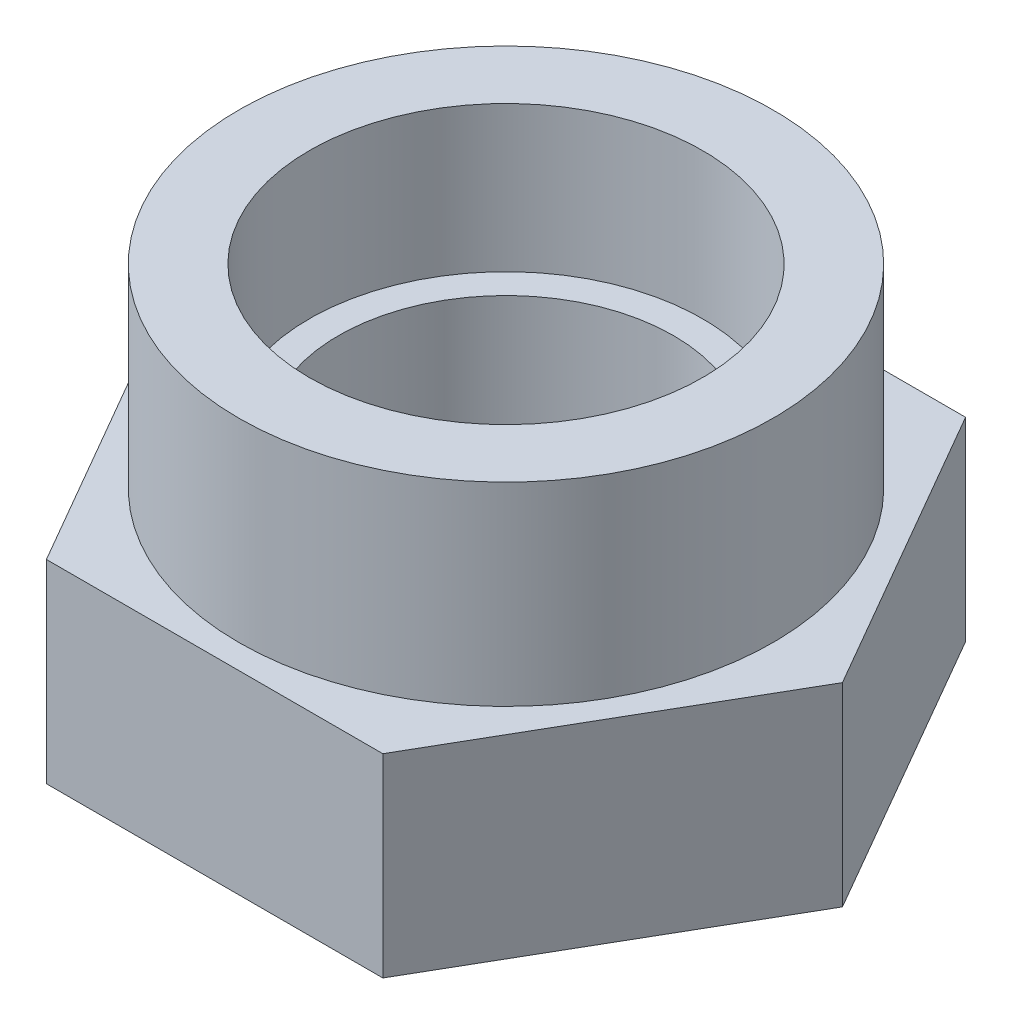
ISO-10303-21;
HEADER;
FILE_DESCRIPTION(('STEP AP214'),'2;1');
FILE_NAME('part.step','',(''),(''),'','','');
FILE_SCHEMA(('AUTOMOTIVE_DESIGN { 1 0 10303 214 1 1 1 1 }'));
ENDSEC;
DATA;
#1=APPLICATION_CONTEXT('core data for automotive mechanical design processes');
#2=APPLICATION_PROTOCOL_DEFINITION('international standard','automotive_design',2000,#1);
#3=PRODUCT_CONTEXT('',#1,'mechanical');
#4=PRODUCT('Part','Part','',(#3));
#5=PRODUCT_RELATED_PRODUCT_CATEGORY('part','',(#4));
#6=PRODUCT_DEFINITION_FORMATION('','',#4);
#7=PRODUCT_DEFINITION_CONTEXT('part definition',#1,'design');
#8=PRODUCT_DEFINITION('design','',#6,#7);
#9=PRODUCT_DEFINITION_SHAPE('','',#8);
#10=(LENGTH_UNIT() NAMED_UNIT(*) SI_UNIT(.MILLI.,.METRE.));
#11=(NAMED_UNIT(*) PLANE_ANGLE_UNIT() SI_UNIT($,.RADIAN.));
#12=(NAMED_UNIT(*) SI_UNIT($,.STERADIAN.) SOLID_ANGLE_UNIT());
#13=UNCERTAINTY_MEASURE_WITH_UNIT(LENGTH_MEASURE(1.E-05),#10,'distance_accuracy_value','');
#14=(GEOMETRIC_REPRESENTATION_CONTEXT(3) GLOBAL_UNCERTAINTY_ASSIGNED_CONTEXT((#13)) GLOBAL_UNIT_ASSIGNED_CONTEXT((#10,
#11,#12)) REPRESENTATION_CONTEXT('',''));
#15=CARTESIAN_POINT('',(0.,0.,0.));
#16=DIRECTION('',(0.,0.,1.));
#17=DIRECTION('',(1.,0.,0.));
#18=AXIS2_PLACEMENT_3D('',#15,#16,#17);
#19=CARTESIAN_POINT('',(0.,8.,0.));
#20=DIRECTION('',(0.,1.,0.));
#21=DIRECTION('',(0.,0.,1.));
#22=AXIS2_PLACEMENT_3D('',#19,#20,#21);
#23=PLANE('',#22);
#24=CARTESIAN_POINT('',(0.,8.,0.));
#25=DIRECTION('',(0.,1.,0.));
#26=DIRECTION('',(0.,0.,1.));
#27=AXIS2_PLACEMENT_3D('',#24,#25,#26);
#28=CIRCLE('',#27,4.05);
#29=CARTESIAN_POINT('',(0.,8.,4.05));
#30=VERTEX_POINT('',#29);
#31=EDGE_CURVE('E89',#30,#30,#28,.T.);
#32=ORIENTED_EDGE('',*,*,#31,.F.);
#33=EDGE_LOOP('',(#32));
#34=FACE_BOUND('',#33,.T.);
#35=CARTESIAN_POINT('',(0.,8.,0.));
#36=DIRECTION('',(0.,1.,0.));
#37=DIRECTION('',(0.,0.,1.));
#38=AXIS2_PLACEMENT_3D('',#35,#36,#37);
#39=CIRCLE('',#38,5.5);
#40=CARTESIAN_POINT('',(0.,8.,5.5));
#41=VERTEX_POINT('',#40);
#42=EDGE_CURVE('E157',#41,#41,#39,.T.);
#43=ORIENTED_EDGE('',*,*,#42,.T.);
#44=EDGE_LOOP('',(#43));
#45=FACE_BOUND('',#44,.T.);
#46=ADVANCED_FACE('F32',(#34,#45),#23,.T.);
#47=CARTESIAN_POINT('',(6.92820323027551,8.,0.));
#48=DIRECTION('',(-0.866025403784439,0.,0.5));
#49=DIRECTION('',(0.5,0.,0.866025403784439));
#50=AXIS2_PLACEMENT_3D('',#47,#48,#49);
#51=PLANE('',#50);
#52=DIRECTION('',(-0.5,0.,-0.866025403784439));
#53=VECTOR('',#52,1.);
#54=CARTESIAN_POINT('',(6.92820323027551,4.,0.));
#55=LINE('',#54,#53);
#56=CARTESIAN_POINT('',(6.92820323027551,4.,0.));
#57=VERTEX_POINT('',#56);
#58=CARTESIAN_POINT('',(3.46410161513776,4.,-6.));
#59=VERTEX_POINT('',#58);
#60=EDGE_CURVE('E84',#57,#59,#55,.T.);
#61=ORIENTED_EDGE('',*,*,#60,.F.);
#62=DIRECTION('',(0.,-1.,0.));
#63=VECTOR('',#62,1.);
#64=CARTESIAN_POINT('',(6.92820323027551,8.,0.));
#65=LINE('',#64,#63);
#66=CARTESIAN_POINT('',(6.92820323027551,0.,0.));
#67=VERTEX_POINT('',#66);
#68=EDGE_CURVE('E54',#57,#67,#65,.T.);
#69=ORIENTED_EDGE('',*,*,#68,.T.);
#70=DIRECTION('',(-0.5,0.,-0.866025403784439));
#71=VECTOR('',#70,1.);
#72=CARTESIAN_POINT('',(6.92820323027551,0.,0.));
#73=LINE('',#72,#71);
#74=CARTESIAN_POINT('',(3.46410161513776,0.,-6.));
#75=VERTEX_POINT('',#74);
#76=EDGE_CURVE('E116',#67,#75,#73,.T.);
#77=ORIENTED_EDGE('',*,*,#76,.T.);
#78=DIRECTION('',(0.,-1.,0.));
#79=VECTOR('',#78,1.);
#80=CARTESIAN_POINT('',(3.46410161513776,8.,-6.));
#81=LINE('',#80,#79);
#82=EDGE_CURVE('E40',#59,#75,#81,.T.);
#83=ORIENTED_EDGE('',*,*,#82,.F.);
#84=EDGE_LOOP('',(#61,#69,#77,#83));
#85=FACE_BOUND('',#84,.T.);
#86=ADVANCED_FACE('F34',(#85),#51,.F.);
#87=CARTESIAN_POINT('',(3.46410161513776,8.,-6.));
#88=DIRECTION('',(0.,0.,1.));
#89=DIRECTION('',(1.,0.,0.));
#90=AXIS2_PLACEMENT_3D('',#87,#88,#89);
#91=PLANE('',#90);
#92=DIRECTION('',(-1.,0.,0.));
#93=VECTOR('',#92,1.);
#94=CARTESIAN_POINT('',(3.46410161513776,4.,-6.));
#95=LINE('',#94,#93);
#96=CARTESIAN_POINT('',(-3.46410161513775,4.,-6.));
#97=VERTEX_POINT('',#96);
#98=EDGE_CURVE('E90',#59,#97,#95,.T.);
#99=ORIENTED_EDGE('',*,*,#98,.F.);
#100=ORIENTED_EDGE('',*,*,#82,.T.);
#101=DIRECTION('',(-1.,0.,0.));
#102=VECTOR('',#101,1.);
#103=CARTESIAN_POINT('',(3.46410161513776,0.,-6.));
#104=LINE('',#103,#102);
#105=CARTESIAN_POINT('',(-3.46410161513775,0.,-6.));
#106=VERTEX_POINT('',#105);
#107=EDGE_CURVE('E127',#75,#106,#104,.T.);
#108=ORIENTED_EDGE('',*,*,#107,.T.);
#109=DIRECTION('',(0.,-1.,0.));
#110=VECTOR('',#109,1.);
#111=CARTESIAN_POINT('',(-3.46410161513775,8.,-6.));
#112=LINE('',#111,#110);
#113=EDGE_CURVE('E107',#97,#106,#112,.T.);
#114=ORIENTED_EDGE('',*,*,#113,.F.);
#115=EDGE_LOOP('',(#99,#100,#108,#114));
#116=FACE_BOUND('',#115,.T.);
#117=ADVANCED_FACE('F148',(#116),#91,.F.);
#118=CARTESIAN_POINT('',(-3.46410161513775,8.,-6.));
#119=DIRECTION('',(0.866025403784439,0.,0.5));
#120=DIRECTION('',(0.5,0.,-0.866025403784439));
#121=AXIS2_PLACEMENT_3D('',#118,#119,#120);
#122=PLANE('',#121);
#123=DIRECTION('',(-0.5,0.,0.866025403784439));
#124=VECTOR('',#123,1.);
#125=CARTESIAN_POINT('',(-3.46410161513775,4.,-6.));
#126=LINE('',#125,#124);
#127=CARTESIAN_POINT('',(-6.92820323027551,4.,0.));
#128=VERTEX_POINT('',#127);
#129=EDGE_CURVE('E150',#97,#128,#126,.T.);
#130=ORIENTED_EDGE('',*,*,#129,.F.);
#131=ORIENTED_EDGE('',*,*,#113,.T.);
#132=DIRECTION('',(-0.5,0.,0.866025403784439));
#133=VECTOR('',#132,1.);
#134=CARTESIAN_POINT('',(-3.46410161513775,0.,-6.));
#135=LINE('',#134,#133);
#136=CARTESIAN_POINT('',(-6.92820323027551,0.,0.));
#137=VERTEX_POINT('',#136);
#138=EDGE_CURVE('E130',#106,#137,#135,.T.);
#139=ORIENTED_EDGE('',*,*,#138,.T.);
#140=DIRECTION('',(0.,-1.,0.));
#141=VECTOR('',#140,1.);
#142=CARTESIAN_POINT('',(-6.92820323027551,8.,0.));
#143=LINE('',#142,#141);
#144=EDGE_CURVE('E105',#128,#137,#143,.T.);
#145=ORIENTED_EDGE('',*,*,#144,.F.);
#146=EDGE_LOOP('',(#130,#131,#139,#145));
#147=FACE_BOUND('',#146,.T.);
#148=ADVANCED_FACE('F198',(#147),#122,.F.);
#149=CARTESIAN_POINT('',(-6.92820323027551,8.,0.));
#150=DIRECTION('',(0.866025403784438,0.,-0.5));
#151=DIRECTION('',(-0.5,0.,-0.866025403784438));
#152=AXIS2_PLACEMENT_3D('',#149,#150,#151);
#153=PLANE('',#152);
#154=DIRECTION('',(0.5,0.,0.866025403784438));
#155=VECTOR('',#154,1.);
#156=CARTESIAN_POINT('',(-6.92820323027551,4.,0.));
#157=LINE('',#156,#155);
#158=CARTESIAN_POINT('',(-3.46410161513775,4.,6.));
#159=VERTEX_POINT('',#158);
#160=EDGE_CURVE('E151',#128,#159,#157,.T.);
#161=ORIENTED_EDGE('',*,*,#160,.F.);
#162=ORIENTED_EDGE('',*,*,#144,.T.);
#163=DIRECTION('',(0.5,0.,0.866025403784438));
#164=VECTOR('',#163,1.);
#165=CARTESIAN_POINT('',(-6.92820323027551,0.,0.));
#166=LINE('',#165,#164);
#167=CARTESIAN_POINT('',(-3.46410161513775,0.,6.));
#168=VERTEX_POINT('',#167);
#169=EDGE_CURVE('E133',#137,#168,#166,.T.);
#170=ORIENTED_EDGE('',*,*,#169,.T.);
#171=DIRECTION('',(0.,-1.,0.));
#172=VECTOR('',#171,1.);
#173=CARTESIAN_POINT('',(-3.46410161513775,8.,6.));
#174=LINE('',#173,#172);
#175=EDGE_CURVE('E98',#159,#168,#174,.T.);
#176=ORIENTED_EDGE('',*,*,#175,.F.);
#177=EDGE_LOOP('',(#161,#162,#170,#176));
#178=FACE_BOUND('',#177,.T.);
#179=ADVANCED_FACE('F195',(#178),#153,.F.);
#180=CARTESIAN_POINT('',(-3.46410161513775,8.,6.));
#181=DIRECTION('',(0.,0.,-1.));
#182=DIRECTION('',(-1.,0.,0.));
#183=AXIS2_PLACEMENT_3D('',#180,#181,#182);
#184=PLANE('',#183);
#185=DIRECTION('',(1.,0.,0.));
#186=VECTOR('',#185,1.);
#187=CARTESIAN_POINT('',(-3.46410161513775,4.,6.));
#188=LINE('',#187,#186);
#189=CARTESIAN_POINT('',(3.46410161513776,4.,6.));
#190=VERTEX_POINT('',#189);
#191=EDGE_CURVE('E46',#159,#190,#188,.T.);
#192=ORIENTED_EDGE('',*,*,#191,.F.);
#193=ORIENTED_EDGE('',*,*,#175,.T.);
#194=DIRECTION('',(1.,0.,0.));
#195=VECTOR('',#194,1.);
#196=CARTESIAN_POINT('',(-3.46410161513775,0.,6.));
#197=LINE('',#196,#195);
#198=CARTESIAN_POINT('',(3.46410161513776,0.,6.));
#199=VERTEX_POINT('',#198);
#200=EDGE_CURVE('E100',#168,#199,#197,.T.);
#201=ORIENTED_EDGE('',*,*,#200,.T.);
#202=DIRECTION('',(0.,-1.,0.));
#203=VECTOR('',#202,1.);
#204=CARTESIAN_POINT('',(3.46410161513776,8.,6.));
#205=LINE('',#204,#203);
#206=EDGE_CURVE('E96',#190,#199,#205,.T.);
#207=ORIENTED_EDGE('',*,*,#206,.F.);
#208=EDGE_LOOP('',(#192,#193,#201,#207));
#209=FACE_BOUND('',#208,.T.);
#210=ADVANCED_FACE('F138',(#209),#184,.F.);
#211=CARTESIAN_POINT('',(3.46410161513776,8.,6.));
#212=DIRECTION('',(-0.866025403784439,0.,-0.5));
#213=DIRECTION('',(-0.5,0.,0.866025403784439));
#214=AXIS2_PLACEMENT_3D('',#211,#212,#213);
#215=PLANE('',#214);
#216=DIRECTION('',(0.5,0.,-0.866025403784439));
#217=VECTOR('',#216,1.);
#218=CARTESIAN_POINT('',(3.46410161513776,4.,6.));
#219=LINE('',#218,#217);
#220=EDGE_CURVE('E11',#190,#57,#219,.T.);
#221=ORIENTED_EDGE('',*,*,#220,.F.);
#222=ORIENTED_EDGE('',*,*,#206,.T.);
#223=DIRECTION('',(0.5,0.,-0.866025403784439));
#224=VECTOR('',#223,1.);
#225=CARTESIAN_POINT('',(3.46410161513776,0.,6.));
#226=LINE('',#225,#224);
#227=EDGE_CURVE('E94',#199,#67,#226,.T.);
#228=ORIENTED_EDGE('',*,*,#227,.T.);
#229=ORIENTED_EDGE('',*,*,#68,.F.);
#230=EDGE_LOOP('',(#221,#222,#228,#229));
#231=FACE_BOUND('',#230,.T.);
#232=ADVANCED_FACE('F92',(#231),#215,.F.);
#233=CARTESIAN_POINT('',(0.,8.,0.));
#234=DIRECTION('',(0.,-1.,0.));
#235=DIRECTION('',(0.,0.,-1.));
#236=AXIS2_PLACEMENT_3D('',#233,#234,#235);
#237=CYLINDRICAL_SURFACE('',#236,3.45);
#238=CARTESIAN_POINT('',(0.,0.,0.));
#239=DIRECTION('',(0.,1.,0.));
#240=DIRECTION('',(0.,0.,1.));
#241=AXIS2_PLACEMENT_3D('',#238,#239,#240);
#242=CIRCLE('',#241,3.45);
#243=CARTESIAN_POINT('',(0.,0.,3.45));
#244=VERTEX_POINT('',#243);
#245=EDGE_CURVE('E111',#244,#244,#242,.T.);
#246=ORIENTED_EDGE('',*,*,#245,.F.);
#247=EDGE_LOOP('',(#246));
#248=FACE_BOUND('',#247,.T.);
#249=CARTESIAN_POINT('',(0.,5.,0.));
#250=DIRECTION('',(0.,1.,0.));
#251=DIRECTION('',(0.,0.,1.));
#252=AXIS2_PLACEMENT_3D('',#249,#250,#251);
#253=CIRCLE('',#252,3.45);
#254=CARTESIAN_POINT('',(0.,5.,3.45));
#255=VERTEX_POINT('',#254);
#256=EDGE_CURVE('E109',#255,#255,#253,.T.);
#257=ORIENTED_EDGE('',*,*,#256,.T.);
#258=EDGE_LOOP('',(#257));
#259=FACE_BOUND('',#258,.T.);
#260=ADVANCED_FACE('F187',(#248,#259),#237,.F.);
#261=CARTESIAN_POINT('',(0.,0.,0.));
#262=DIRECTION('',(0.,1.,0.));
#263=DIRECTION('',(0.,0.,1.));
#264=AXIS2_PLACEMENT_3D('',#261,#262,#263);
#265=PLANE('',#264);
#266=ORIENTED_EDGE('',*,*,#76,.F.);
#267=ORIENTED_EDGE('',*,*,#227,.F.);
#268=ORIENTED_EDGE('',*,*,#200,.F.);
#269=ORIENTED_EDGE('',*,*,#169,.F.);
#270=ORIENTED_EDGE('',*,*,#138,.F.);
#271=ORIENTED_EDGE('',*,*,#107,.F.);
#272=EDGE_LOOP('',(#266,#267,#268,#269,#270,#271));
#273=FACE_BOUND('',#272,.T.);
#274=ORIENTED_EDGE('',*,*,#245,.T.);
#275=EDGE_LOOP('',(#274));
#276=FACE_BOUND('',#275,.T.);
#277=ADVANCED_FACE('F142',(#273,#276),#265,.F.);
#278=CARTESIAN_POINT('',(0.,5.,0.));
#279=DIRECTION('',(0.,1.,0.));
#280=DIRECTION('',(0.,0.,1.));
#281=AXIS2_PLACEMENT_3D('',#278,#279,#280);
#282=CYLINDRICAL_SURFACE('',#281,4.05);
#283=CARTESIAN_POINT('',(0.,5.,0.));
#284=DIRECTION('',(0.,1.,0.));
#285=DIRECTION('',(0.,0.,1.));
#286=AXIS2_PLACEMENT_3D('',#283,#284,#285);
#287=CIRCLE('',#286,4.05);
#288=CARTESIAN_POINT('',(0.,5.,4.05));
#289=VERTEX_POINT('',#288);
#290=EDGE_CURVE('E112',#289,#289,#287,.T.);
#291=ORIENTED_EDGE('',*,*,#290,.F.);
#292=EDGE_LOOP('',(#291));
#293=FACE_BOUND('',#292,.T.);
#294=ORIENTED_EDGE('',*,*,#31,.T.);
#295=EDGE_LOOP('',(#294));
#296=FACE_BOUND('',#295,.T.);
#297=ADVANCED_FACE('F174',(#293,#296),#282,.F.);
#298=CARTESIAN_POINT('',(0.,5.,0.));
#299=DIRECTION('',(0.,1.,0.));
#300=DIRECTION('',(0.,0.,1.));
#301=AXIS2_PLACEMENT_3D('',#298,#299,#300);
#302=PLANE('',#301);
#303=ORIENTED_EDGE('',*,*,#256,.F.);
#304=EDGE_LOOP('',(#303));
#305=FACE_BOUND('',#304,.T.);
#306=ORIENTED_EDGE('',*,*,#290,.T.);
#307=EDGE_LOOP('',(#306));
#308=FACE_BOUND('',#307,.T.);
#309=ADVANCED_FACE('F167',(#305,#308),#302,.T.);
#310=CARTESIAN_POINT('',(0.,4.,0.));
#311=DIRECTION('',(0.,1.,0.));
#312=DIRECTION('',(0.,0.,1.));
#313=AXIS2_PLACEMENT_3D('',#310,#311,#312);
#314=PLANE('',#313);
#315=CARTESIAN_POINT('',(0.,4.,0.));
#316=DIRECTION('',(0.,1.,0.));
#317=DIRECTION('',(0.,0.,1.));
#318=AXIS2_PLACEMENT_3D('',#315,#316,#317);
#319=CIRCLE('',#318,5.5);
#320=CARTESIAN_POINT('',(0.,4.,5.5));
#321=VERTEX_POINT('',#320);
#322=EDGE_CURVE('E156',#321,#321,#319,.T.);
#323=ORIENTED_EDGE('',*,*,#322,.F.);
#324=EDGE_LOOP('',(#323));
#325=FACE_BOUND('',#324,.T.);
#326=ORIENTED_EDGE('',*,*,#60,.T.);
#327=ORIENTED_EDGE('',*,*,#98,.T.);
#328=ORIENTED_EDGE('',*,*,#129,.T.);
#329=ORIENTED_EDGE('',*,*,#160,.T.);
#330=ORIENTED_EDGE('',*,*,#191,.T.);
#331=ORIENTED_EDGE('',*,*,#220,.T.);
#332=EDGE_LOOP('',(#326,#327,#328,#329,#330,#331));
#333=FACE_BOUND('',#332,.T.);
#334=ADVANCED_FACE('F83',(#325,#333),#314,.T.);
#335=CARTESIAN_POINT('',(0.,4.,0.));
#336=DIRECTION('',(0.,1.,0.));
#337=DIRECTION('',(0.,0.,1.));
#338=AXIS2_PLACEMENT_3D('',#335,#336,#337);
#339=CYLINDRICAL_SURFACE('',#338,5.5);
#340=ORIENTED_EDGE('',*,*,#322,.T.);
#341=EDGE_LOOP('',(#340));
#342=FACE_BOUND('',#341,.T.);
#343=ORIENTED_EDGE('',*,*,#42,.F.);
#344=EDGE_LOOP('',(#343));
#345=FACE_BOUND('',#344,.T.);
#346=ADVANCED_FACE('F163',(#342,#345),#339,.T.);
#347=CLOSED_SHELL('',(#46,#86,#117,#148,#179,#210,#232,#260,#277,#297,#309,#334,#346));
#348=MANIFOLD_SOLID_BREP('B2',#347);
#349=ADVANCED_BREP_SHAPE_REPRESENTATION('',(#18,#348),#14);
#350=SHAPE_DEFINITION_REPRESENTATION(#9,#349);
ENDSEC;
END-ISO-10303-21;
